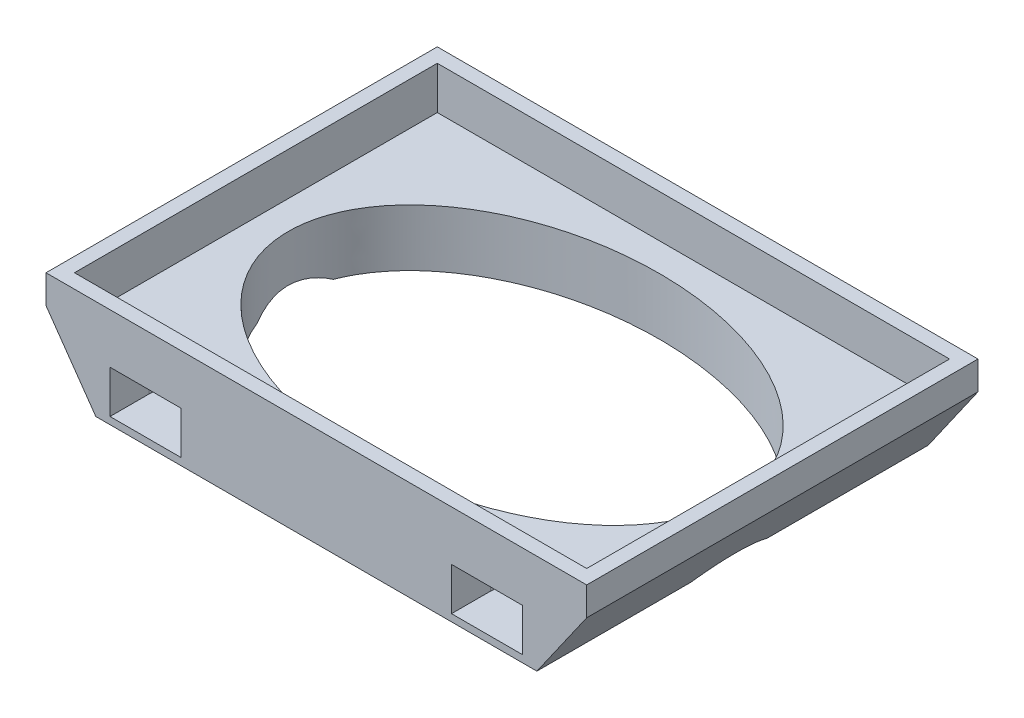
ISO-10303-21;
HEADER;
FILE_DESCRIPTION(('STEP AP214'),'2;1');
FILE_NAME('part.step','',(''),(''),'','','');
FILE_SCHEMA(('AUTOMOTIVE_DESIGN { 1 0 10303 214 1 1 1 1 }'));
ENDSEC;
DATA;
#1=APPLICATION_CONTEXT('core data for automotive mechanical design processes');
#2=APPLICATION_PROTOCOL_DEFINITION('international standard','automotive_design',2000,#1);
#3=PRODUCT_CONTEXT('',#1,'mechanical');
#4=PRODUCT('Part','Part','',(#3));
#5=PRODUCT_RELATED_PRODUCT_CATEGORY('part','',(#4));
#6=PRODUCT_DEFINITION_FORMATION('','',#4);
#7=PRODUCT_DEFINITION_CONTEXT('part definition',#1,'design');
#8=PRODUCT_DEFINITION('design','',#6,#7);
#9=PRODUCT_DEFINITION_SHAPE('','',#8);
#10=(LENGTH_UNIT() NAMED_UNIT(*) SI_UNIT(.MILLI.,.METRE.));
#11=(NAMED_UNIT(*) PLANE_ANGLE_UNIT() SI_UNIT($,.RADIAN.));
#12=(NAMED_UNIT(*) SI_UNIT($,.STERADIAN.) SOLID_ANGLE_UNIT());
#13=UNCERTAINTY_MEASURE_WITH_UNIT(LENGTH_MEASURE(1.E-05),#10,'distance_accuracy_value','');
#14=(GEOMETRIC_REPRESENTATION_CONTEXT(3) GLOBAL_UNCERTAINTY_ASSIGNED_CONTEXT((#13)) GLOBAL_UNIT_ASSIGNED_CONTEXT((#10,
#11,#12)) REPRESENTATION_CONTEXT('',''));
#15=CARTESIAN_POINT('',(0.,0.,0.));
#16=DIRECTION('',(0.,0.,1.));
#17=DIRECTION('',(1.,0.,0.));
#18=AXIS2_PLACEMENT_3D('',#15,#16,#17);
#19=CARTESIAN_POINT('',(0.,-7.,0.));
#20=DIRECTION('',(0.,-1.,0.));
#21=DIRECTION('',(0.,0.,-1.));
#22=AXIS2_PLACEMENT_3D('',#19,#20,#21);
#23=PLANE('',#22);
#24=DIRECTION('',(0.,0.,1.));
#25=VECTOR('',#24,1.);
#26=CARTESIAN_POINT('',(-15.4989623089515,-7.,-13.75));
#27=LINE('',#26,#25);
#28=CARTESIAN_POINT('',(-15.4989623089515,-7.,-13.75));
#29=VERTEX_POINT('',#28);
#30=CARTESIAN_POINT('',(-15.4989623089515,-7.,-2.94454676204636));
#31=VERTEX_POINT('',#30);
#32=EDGE_CURVE('E61',#29,#31,#27,.T.);
#33=ORIENTED_EDGE('',*,*,#32,.F.);
#34=DIRECTION('',(-1.,0.,0.));
#35=VECTOR('',#34,1.);
#36=CARTESIAN_POINT('',(-19.,-7.,-13.75));
#37=LINE('',#36,#35);
#38=CARTESIAN_POINT('',(15.4989623089515,-7.,-13.75));
#39=VERTEX_POINT('',#38);
#40=EDGE_CURVE('E243',#39,#29,#37,.T.);
#41=ORIENTED_EDGE('',*,*,#40,.F.);
#42=DIRECTION('',(0.,0.,1.));
#43=VECTOR('',#42,1.);
#44=CARTESIAN_POINT('',(15.4989623089515,-7.,-13.75));
#45=LINE('',#44,#43);
#46=CARTESIAN_POINT('',(15.4989623089515,-7.,-2.41548609609659));
#47=VERTEX_POINT('',#46);
#48=EDGE_CURVE('E240',#39,#47,#45,.T.);
#49=ORIENTED_EDGE('',*,*,#48,.T.);
#50=CARTESIAN_POINT('',(0.,-7.,0.));
#51=DIRECTION('',(0.,1.,0.));
#52=DIRECTION('',(0.999515945982097,0.,0.0311106690303014));
#53=AXIS2_PLACEMENT_3D('',#50,#51,#52);
#54=ELLIPSE('',#53,16.0077486150347,10.7552061007264);
#55=EDGE_CURVE('E276',#47,#31,#54,.T.);
#56=ORIENTED_EDGE('',*,*,#55,.T.);
#57=EDGE_LOOP('',(#33,#41,#49,#56));
#58=FACE_BOUND('',#57,.T.);
#59=ADVANCED_FACE('F32',(#58),#23,.T.);
#60=CARTESIAN_POINT('',(-19.,-7.,-13.75));
#61=DIRECTION('',(0.,0.,-1.));
#62=DIRECTION('',(-1.,0.,0.));
#63=AXIS2_PLACEMENT_3D('',#60,#61,#62);
#64=PLANE('',#63);
#65=DIRECTION('',(-0.573576436351042,0.819152044288995,0.));
#66=VECTOR('',#65,1.);
#67=CARTESIAN_POINT('',(-15.4989623089515,-7.,-13.75));
#68=LINE('',#67,#66);
#69=CARTESIAN_POINT('',(-19.,-2.,-13.75));
#70=VERTEX_POINT('',#69);
#71=EDGE_CURVE('E229',#29,#70,#68,.T.);
#72=ORIENTED_EDGE('',*,*,#71,.T.);
#73=DIRECTION('',(0.,1.,0.));
#74=VECTOR('',#73,1.);
#75=CARTESIAN_POINT('',(-19.,-7.,-13.75));
#76=LINE('',#75,#74);
#77=CARTESIAN_POINT('',(-19.,0.,-13.75));
#78=VERTEX_POINT('',#77);
#79=EDGE_CURVE('E264',#70,#78,#76,.T.);
#80=ORIENTED_EDGE('',*,*,#79,.T.);
#81=DIRECTION('',(-1.,0.,0.));
#82=VECTOR('',#81,1.);
#83=CARTESIAN_POINT('',(-19.,0.,-13.75));
#84=LINE('',#83,#82);
#85=CARTESIAN_POINT('',(19.,0.,-13.75));
#86=VERTEX_POINT('',#85);
#87=EDGE_CURVE('E244',#86,#78,#84,.T.);
#88=ORIENTED_EDGE('',*,*,#87,.F.);
#89=DIRECTION('',(0.,1.,0.));
#90=VECTOR('',#89,1.);
#91=CARTESIAN_POINT('',(19.,-7.,-13.75));
#92=LINE('',#91,#90);
#93=CARTESIAN_POINT('',(19.,-2.,-13.75));
#94=VERTEX_POINT('',#93);
#95=EDGE_CURVE('E267',#94,#86,#92,.T.);
#96=ORIENTED_EDGE('',*,*,#95,.F.);
#97=DIRECTION('',(-0.573576436351042,-0.819152044288995,0.));
#98=VECTOR('',#97,1.);
#99=CARTESIAN_POINT('',(15.4989623089515,-7.,-13.75));
#100=LINE('',#99,#98);
#101=EDGE_CURVE('E764',#94,#39,#100,.T.);
#102=ORIENTED_EDGE('',*,*,#101,.T.);
#103=ORIENTED_EDGE('',*,*,#40,.T.);
#104=EDGE_LOOP('',(#72,#80,#88,#96,#102,#103));
#105=FACE_BOUND('',#104,.T.);
#106=DIRECTION('',(1.,0.,0.));
#107=VECTOR('',#106,1.);
#108=CARTESIAN_POINT('',(-19.,-3.5,-13.75));
#109=LINE('',#108,#107);
#110=CARTESIAN_POINT('',(-14.5,-3.5,-13.75));
#111=VERTEX_POINT('',#110);
#112=CARTESIAN_POINT('',(-9.5,-3.5,-13.75));
#113=VERTEX_POINT('',#112);
#114=EDGE_CURVE('E314',#111,#113,#109,.T.);
#115=ORIENTED_EDGE('',*,*,#114,.F.);
#116=DIRECTION('',(0.,1.,0.));
#117=VECTOR('',#116,1.);
#118=CARTESIAN_POINT('',(-14.5,-7.,-13.75));
#119=LINE('',#118,#117);
#120=CARTESIAN_POINT('',(-14.5,-6.5,-13.75));
#121=VERTEX_POINT('',#120);
#122=EDGE_CURVE('E309',#121,#111,#119,.T.);
#123=ORIENTED_EDGE('',*,*,#122,.F.);
#124=DIRECTION('',(1.,0.,0.));
#125=VECTOR('',#124,1.);
#126=CARTESIAN_POINT('',(-19.,-6.5,-13.75));
#127=LINE('',#126,#125);
#128=CARTESIAN_POINT('',(-9.49999999999996,-6.5,-13.75));
#129=VERTEX_POINT('',#128);
#130=EDGE_CURVE('E306',#121,#129,#127,.T.);
#131=ORIENTED_EDGE('',*,*,#130,.T.);
#132=DIRECTION('',(0.,-1.,0.));
#133=VECTOR('',#132,1.);
#134=CARTESIAN_POINT('',(-9.5,-7.,-13.75));
#135=LINE('',#134,#133);
#136=EDGE_CURVE('E311',#113,#129,#135,.T.);
#137=ORIENTED_EDGE('',*,*,#136,.F.);
#138=EDGE_LOOP('',(#115,#123,#131,#137));
#139=FACE_BOUND('',#138,.T.);
#140=DIRECTION('',(0.,-1.,0.));
#141=VECTOR('',#140,1.);
#142=CARTESIAN_POINT('',(14.5,-7.,-13.75));
#143=LINE('',#142,#141);
#144=CARTESIAN_POINT('',(14.5,-3.5,-13.75));
#145=VERTEX_POINT('',#144);
#146=CARTESIAN_POINT('',(14.5,-6.5,-13.75));
#147=VERTEX_POINT('',#146);
#148=EDGE_CURVE('E300',#145,#147,#143,.T.);
#149=ORIENTED_EDGE('',*,*,#148,.F.);
#150=DIRECTION('',(-1.,0.,0.));
#151=VECTOR('',#150,1.);
#152=CARTESIAN_POINT('',(-19.,-3.5,-13.75));
#153=LINE('',#152,#151);
#154=CARTESIAN_POINT('',(9.49999999999999,-3.5,-13.75));
#155=VERTEX_POINT('',#154);
#156=EDGE_CURVE('E303',#145,#155,#153,.T.);
#157=ORIENTED_EDGE('',*,*,#156,.T.);
#158=DIRECTION('',(0.,1.,0.));
#159=VECTOR('',#158,1.);
#160=CARTESIAN_POINT('',(9.49999999999999,-7.,-13.75));
#161=LINE('',#160,#159);
#162=CARTESIAN_POINT('',(9.49999999999999,-6.5,-13.75));
#163=VERTEX_POINT('',#162);
#164=EDGE_CURVE('E298',#163,#155,#161,.T.);
#165=ORIENTED_EDGE('',*,*,#164,.F.);
#166=DIRECTION('',(-1.,0.,0.));
#167=VECTOR('',#166,1.);
#168=CARTESIAN_POINT('',(-19.,-6.5,-13.75));
#169=LINE('',#168,#167);
#170=EDGE_CURVE('E296',#147,#163,#169,.T.);
#171=ORIENTED_EDGE('',*,*,#170,.F.);
#172=EDGE_LOOP('',(#149,#157,#165,#171));
#173=FACE_BOUND('',#172,.T.);
#174=ADVANCED_FACE('F412',(#105,#139,#173),#64,.T.);
#175=CARTESIAN_POINT('',(-19.,-7.,13.75));
#176=DIRECTION('',(0.,0.,1.));
#177=DIRECTION('',(1.,0.,0.));
#178=AXIS2_PLACEMENT_3D('',#175,#176,#177);
#179=PLANE('',#178);
#180=DIRECTION('',(-0.573576436351042,0.819152044288995,0.));
#181=VECTOR('',#180,1.);
#182=CARTESIAN_POINT('',(-15.4989623089515,-7.,13.75));
#183=LINE('',#182,#181);
#184=CARTESIAN_POINT('',(-15.4989623089515,-7.,13.75));
#185=VERTEX_POINT('',#184);
#186=CARTESIAN_POINT('',(-19.,-2.,13.75));
#187=VERTEX_POINT('',#186);
#188=EDGE_CURVE('E223',#185,#187,#183,.T.);
#189=ORIENTED_EDGE('',*,*,#188,.F.);
#190=DIRECTION('',(1.,0.,0.));
#191=VECTOR('',#190,1.);
#192=CARTESIAN_POINT('',(-19.,-7.,13.75));
#193=LINE('',#192,#191);
#194=CARTESIAN_POINT('',(15.4989623089515,-7.,13.75));
#195=VERTEX_POINT('',#194);
#196=EDGE_CURVE('E237',#185,#195,#193,.T.);
#197=ORIENTED_EDGE('',*,*,#196,.T.);
#198=DIRECTION('',(-0.573576436351042,-0.819152044288995,0.));
#199=VECTOR('',#198,1.);
#200=CARTESIAN_POINT('',(15.4989623089515,-7.,13.75));
#201=LINE('',#200,#199);
#202=CARTESIAN_POINT('',(19.,-2.,13.75));
#203=VERTEX_POINT('',#202);
#204=EDGE_CURVE('E769',#203,#195,#201,.T.);
#205=ORIENTED_EDGE('',*,*,#204,.F.);
#206=DIRECTION('',(0.,1.,0.));
#207=VECTOR('',#206,1.);
#208=CARTESIAN_POINT('',(19.,-7.,13.75));
#209=LINE('',#208,#207);
#210=CARTESIAN_POINT('',(19.,0.,13.75));
#211=VERTEX_POINT('',#210);
#212=EDGE_CURVE('E269',#203,#211,#209,.T.);
#213=ORIENTED_EDGE('',*,*,#212,.T.);
#214=DIRECTION('',(1.,0.,0.));
#215=VECTOR('',#214,1.);
#216=CARTESIAN_POINT('',(-19.,0.,13.75));
#217=LINE('',#216,#215);
#218=CARTESIAN_POINT('',(-19.,0.,13.75));
#219=VERTEX_POINT('',#218);
#220=EDGE_CURVE('E258',#219,#211,#217,.T.);
#221=ORIENTED_EDGE('',*,*,#220,.F.);
#222=DIRECTION('',(0.,1.,0.));
#223=VECTOR('',#222,1.);
#224=CARTESIAN_POINT('',(-19.,-7.,13.75));
#225=LINE('',#224,#223);
#226=EDGE_CURVE('E239',#187,#219,#225,.T.);
#227=ORIENTED_EDGE('',*,*,#226,.F.);
#228=EDGE_LOOP('',(#189,#197,#205,#213,#221,#227));
#229=FACE_BOUND('',#228,.T.);
#230=DIRECTION('',(-1.,0.,0.));
#231=VECTOR('',#230,1.);
#232=CARTESIAN_POINT('',(-19.,-3.5,13.75));
#233=LINE('',#232,#231);
#234=CARTESIAN_POINT('',(14.5,-3.5,13.75));
#235=VERTEX_POINT('',#234);
#236=CARTESIAN_POINT('',(9.49999999999999,-3.5,13.75));
#237=VERTEX_POINT('',#236);
#238=EDGE_CURVE('E294',#235,#237,#233,.T.);
#239=ORIENTED_EDGE('',*,*,#238,.F.);
#240=DIRECTION('',(0.,1.,0.));
#241=VECTOR('',#240,1.);
#242=CARTESIAN_POINT('',(14.5,-7.,13.75));
#243=LINE('',#242,#241);
#244=CARTESIAN_POINT('',(14.5,-6.5,13.75));
#245=VERTEX_POINT('',#244);
#246=EDGE_CURVE('E289',#245,#235,#243,.T.);
#247=ORIENTED_EDGE('',*,*,#246,.F.);
#248=DIRECTION('',(-1.,0.,0.));
#249=VECTOR('',#248,1.);
#250=CARTESIAN_POINT('',(-19.,-6.5,13.75));
#251=LINE('',#250,#249);
#252=CARTESIAN_POINT('',(9.49999999999995,-6.5,13.75));
#253=VERTEX_POINT('',#252);
#254=EDGE_CURVE('E286',#245,#253,#251,.T.);
#255=ORIENTED_EDGE('',*,*,#254,.T.);
#256=DIRECTION('',(0.,-1.,0.));
#257=VECTOR('',#256,1.);
#258=CARTESIAN_POINT('',(9.49999999999999,-7.,13.75));
#259=LINE('',#258,#257);
#260=EDGE_CURVE('E291',#237,#253,#259,.T.);
#261=ORIENTED_EDGE('',*,*,#260,.F.);
#262=EDGE_LOOP('',(#239,#247,#255,#261));
#263=FACE_BOUND('',#262,.T.);
#264=DIRECTION('',(0.,-1.,0.));
#265=VECTOR('',#264,1.);
#266=CARTESIAN_POINT('',(-14.5,-7.,13.75));
#267=LINE('',#266,#265);
#268=CARTESIAN_POINT('',(-14.5,-3.5,13.75));
#269=VERTEX_POINT('',#268);
#270=CARTESIAN_POINT('',(-14.5,-6.5,13.75));
#271=VERTEX_POINT('',#270);
#272=EDGE_CURVE('E280',#269,#271,#267,.T.);
#273=ORIENTED_EDGE('',*,*,#272,.F.);
#274=DIRECTION('',(1.,0.,0.));
#275=VECTOR('',#274,1.);
#276=CARTESIAN_POINT('',(-19.,-3.5,13.75));
#277=LINE('',#276,#275);
#278=CARTESIAN_POINT('',(-9.5,-3.5,13.75));
#279=VERTEX_POINT('',#278);
#280=EDGE_CURVE('E283',#269,#279,#277,.T.);
#281=ORIENTED_EDGE('',*,*,#280,.T.);
#282=DIRECTION('',(0.,1.,0.));
#283=VECTOR('',#282,1.);
#284=CARTESIAN_POINT('',(-9.5,-7.,13.75));
#285=LINE('',#284,#283);
#286=CARTESIAN_POINT('',(-9.5,-6.5,13.75));
#287=VERTEX_POINT('',#286);
#288=EDGE_CURVE('E278',#287,#279,#285,.T.);
#289=ORIENTED_EDGE('',*,*,#288,.F.);
#290=DIRECTION('',(1.,0.,0.));
#291=VECTOR('',#290,1.);
#292=CARTESIAN_POINT('',(-19.,-6.5,13.75));
#293=LINE('',#292,#291);
#294=EDGE_CURVE('E266',#271,#287,#293,.T.);
#295=ORIENTED_EDGE('',*,*,#294,.F.);
#296=EDGE_LOOP('',(#273,#281,#289,#295));
#297=FACE_BOUND('',#296,.T.);
#298=ADVANCED_FACE('F234',(#229,#263,#297),#179,.T.);
#299=CARTESIAN_POINT('',(-19.,-7.,13.75));
#300=DIRECTION('',(-1.,0.,0.));
#301=DIRECTION('',(0.,0.,1.));
#302=AXIS2_PLACEMENT_3D('',#299,#300,#301);
#303=PLANE('',#302);
#304=DIRECTION('',(0.,0.,1.));
#305=VECTOR('',#304,1.);
#306=CARTESIAN_POINT('',(-19.,-2.,-13.75));
#307=LINE('',#306,#305);
#308=EDGE_CURVE('E715',#70,#187,#307,.T.);
#309=ORIENTED_EDGE('',*,*,#308,.T.);
#310=ORIENTED_EDGE('',*,*,#226,.T.);
#311=DIRECTION('',(0.,0.,1.));
#312=VECTOR('',#311,1.);
#313=CARTESIAN_POINT('',(-19.,0.,13.75));
#314=LINE('',#313,#312);
#315=EDGE_CURVE('E255',#78,#219,#314,.T.);
#316=ORIENTED_EDGE('',*,*,#315,.F.);
#317=ORIENTED_EDGE('',*,*,#79,.F.);
#318=EDGE_LOOP('',(#309,#310,#316,#317));
#319=FACE_BOUND('',#318,.T.);
#320=ADVANCED_FACE('F34',(#319),#303,.T.);
#321=CARTESIAN_POINT('',(19.,-7.,13.75));
#322=DIRECTION('',(1.,0.,0.));
#323=DIRECTION('',(0.,0.,-1.));
#324=AXIS2_PLACEMENT_3D('',#321,#322,#323);
#325=PLANE('',#324);
#326=DIRECTION('',(0.,0.,1.));
#327=VECTOR('',#326,1.);
#328=CARTESIAN_POINT('',(19.,-2.,-13.75));
#329=LINE('',#328,#327);
#330=EDGE_CURVE('E762',#94,#203,#329,.T.);
#331=ORIENTED_EDGE('',*,*,#330,.F.);
#332=ORIENTED_EDGE('',*,*,#95,.T.);
#333=DIRECTION('',(0.,0.,-1.));
#334=VECTOR('',#333,1.);
#335=CARTESIAN_POINT('',(19.,0.,13.75));
#336=LINE('',#335,#334);
#337=EDGE_CURVE('E249',#211,#86,#336,.T.);
#338=ORIENTED_EDGE('',*,*,#337,.F.);
#339=ORIENTED_EDGE('',*,*,#212,.F.);
#340=EDGE_LOOP('',(#331,#332,#338,#339));
#341=FACE_BOUND('',#340,.T.);
#342=ADVANCED_FACE('F424',(#341),#325,.T.);
#343=CARTESIAN_POINT('',(-15.4989623089515,-7.,2.41548609609659));
#344=VERTEX_POINT('',#343);
#345=EDGE_CURVE('E220',#344,#185,#27,.T.);
#346=ORIENTED_EDGE('',*,*,#345,.F.);
#347=CARTESIAN_POINT('',(15.4989623089515,-7.,2.94454676204636));
#348=VERTEX_POINT('',#347);
#349=EDGE_CURVE('E677',#344,#348,#54,.T.);
#350=ORIENTED_EDGE('',*,*,#349,.T.);
#351=EDGE_CURVE('E53',#348,#195,#45,.T.);
#352=ORIENTED_EDGE('',*,*,#351,.T.);
#353=ORIENTED_EDGE('',*,*,#196,.F.);
#354=EDGE_LOOP('',(#346,#350,#352,#353));
#355=FACE_BOUND('',#354,.T.);
#356=ADVANCED_FACE('F242',(#355),#23,.T.);
#357=CARTESIAN_POINT('',(0.,0.,0.));
#358=DIRECTION('',(0.,-1.,0.));
#359=DIRECTION('',(0.,0.,-1.));
#360=AXIS2_PLACEMENT_3D('',#357,#358,#359);
#361=PLANE('',#360);
#362=DIRECTION('',(1.,0.,0.));
#363=VECTOR('',#362,1.);
#364=CARTESIAN_POINT('',(-18.,0.,12.75));
#365=LINE('',#364,#363);
#366=CARTESIAN_POINT('',(-18.,0.,12.75));
#367=VERTEX_POINT('',#366);
#368=CARTESIAN_POINT('',(18.,0.,12.75));
#369=VERTEX_POINT('',#368);
#370=EDGE_CURVE('E644',#367,#369,#365,.T.);
#371=ORIENTED_EDGE('',*,*,#370,.F.);
#372=DIRECTION('',(0.,0.,1.));
#373=VECTOR('',#372,1.);
#374=CARTESIAN_POINT('',(-18.,0.,-12.75));
#375=LINE('',#374,#373);
#376=CARTESIAN_POINT('',(-18.,0.,-12.75));
#377=VERTEX_POINT('',#376);
#378=EDGE_CURVE('E275',#377,#367,#375,.T.);
#379=ORIENTED_EDGE('',*,*,#378,.F.);
#380=DIRECTION('',(-1.,0.,0.));
#381=VECTOR('',#380,1.);
#382=CARTESIAN_POINT('',(-18.,0.,-12.75));
#383=LINE('',#382,#381);
#384=CARTESIAN_POINT('',(18.,0.,-12.75));
#385=VERTEX_POINT('',#384);
#386=EDGE_CURVE('E657',#385,#377,#383,.T.);
#387=ORIENTED_EDGE('',*,*,#386,.F.);
#388=DIRECTION('',(0.,0.,-1.));
#389=VECTOR('',#388,1.);
#390=CARTESIAN_POINT('',(18.,0.,-12.75));
#391=LINE('',#390,#389);
#392=EDGE_CURVE('E655',#369,#385,#391,.T.);
#393=ORIENTED_EDGE('',*,*,#392,.F.);
#394=EDGE_LOOP('',(#371,#379,#387,#393));
#395=FACE_BOUND('',#394,.T.);
#396=ORIENTED_EDGE('',*,*,#315,.T.);
#397=ORIENTED_EDGE('',*,*,#220,.T.);
#398=ORIENTED_EDGE('',*,*,#337,.T.);
#399=ORIENTED_EDGE('',*,*,#87,.T.);
#400=EDGE_LOOP('',(#396,#397,#398,#399));
#401=FACE_BOUND('',#400,.T.);
#402=ADVANCED_FACE('F423',(#395,#401),#361,.F.);
#403=CARTESIAN_POINT('',(-18.,-3.,-12.75));
#404=DIRECTION('',(-1.,0.,0.));
#405=DIRECTION('',(0.,0.,1.));
#406=AXIS2_PLACEMENT_3D('',#403,#404,#405);
#407=PLANE('',#406);
#408=ORIENTED_EDGE('',*,*,#378,.T.);
#409=DIRECTION('',(0.,1.,0.));
#410=VECTOR('',#409,1.);
#411=CARTESIAN_POINT('',(-18.,-3.,12.75));
#412=LINE('',#411,#410);
#413=CARTESIAN_POINT('',(-18.,-3.,12.75));
#414=VERTEX_POINT('',#413);
#415=EDGE_CURVE('E252',#414,#367,#412,.T.);
#416=ORIENTED_EDGE('',*,*,#415,.F.);
#417=DIRECTION('',(0.,0.,1.));
#418=VECTOR('',#417,1.);
#419=CARTESIAN_POINT('',(-18.,-3.,-12.75));
#420=LINE('',#419,#418);
#421=CARTESIAN_POINT('',(-18.,-3.,-12.75));
#422=VERTEX_POINT('',#421);
#423=EDGE_CURVE('E662',#422,#414,#420,.T.);
#424=ORIENTED_EDGE('',*,*,#423,.F.);
#425=DIRECTION('',(0.,1.,0.));
#426=VECTOR('',#425,1.);
#427=CARTESIAN_POINT('',(-18.,-3.,-12.75));
#428=LINE('',#427,#426);
#429=EDGE_CURVE('E259',#422,#377,#428,.T.);
#430=ORIENTED_EDGE('',*,*,#429,.T.);
#431=EDGE_LOOP('',(#408,#416,#424,#430));
#432=FACE_BOUND('',#431,.T.);
#433=ADVANCED_FACE('F429',(#432),#407,.F.);
#434=CARTESIAN_POINT('',(-18.,-3.,-12.75));
#435=DIRECTION('',(0.,0.,-1.));
#436=DIRECTION('',(-1.,0.,0.));
#437=AXIS2_PLACEMENT_3D('',#434,#435,#436);
#438=PLANE('',#437);
#439=ORIENTED_EDGE('',*,*,#386,.T.);
#440=ORIENTED_EDGE('',*,*,#429,.F.);
#441=DIRECTION('',(-1.,0.,0.));
#442=VECTOR('',#441,1.);
#443=CARTESIAN_POINT('',(-18.,-3.,-12.75));
#444=LINE('',#443,#442);
#445=CARTESIAN_POINT('',(18.,-3.,-12.75));
#446=VERTEX_POINT('',#445);
#447=EDGE_CURVE('E652',#446,#422,#444,.T.);
#448=ORIENTED_EDGE('',*,*,#447,.F.);
#449=DIRECTION('',(0.,1.,0.));
#450=VECTOR('',#449,1.);
#451=CARTESIAN_POINT('',(18.,-3.,-12.75));
#452=LINE('',#451,#450);
#453=EDGE_CURVE('E664',#446,#385,#452,.T.);
#454=ORIENTED_EDGE('',*,*,#453,.T.);
#455=EDGE_LOOP('',(#439,#440,#448,#454));
#456=FACE_BOUND('',#455,.T.);
#457=ADVANCED_FACE('F610',(#456),#438,.F.);
#458=CARTESIAN_POINT('',(18.,-3.,-12.75));
#459=DIRECTION('',(1.,0.,0.));
#460=DIRECTION('',(0.,0.,-1.));
#461=AXIS2_PLACEMENT_3D('',#458,#459,#460);
#462=PLANE('',#461);
#463=ORIENTED_EDGE('',*,*,#392,.T.);
#464=ORIENTED_EDGE('',*,*,#453,.F.);
#465=DIRECTION('',(0.,0.,-1.));
#466=VECTOR('',#465,1.);
#467=CARTESIAN_POINT('',(18.,-3.,-12.75));
#468=LINE('',#467,#466);
#469=CARTESIAN_POINT('',(18.,-3.,12.75));
#470=VERTEX_POINT('',#469);
#471=EDGE_CURVE('E667',#470,#446,#468,.T.);
#472=ORIENTED_EDGE('',*,*,#471,.F.);
#473=DIRECTION('',(0.,1.,0.));
#474=VECTOR('',#473,1.);
#475=CARTESIAN_POINT('',(18.,-3.,12.75));
#476=LINE('',#475,#474);
#477=EDGE_CURVE('E651',#470,#369,#476,.T.);
#478=ORIENTED_EDGE('',*,*,#477,.T.);
#479=EDGE_LOOP('',(#463,#464,#472,#478));
#480=FACE_BOUND('',#479,.T.);
#481=ADVANCED_FACE('F600',(#480),#462,.F.);
#482=CARTESIAN_POINT('',(-18.,-3.,12.75));
#483=DIRECTION('',(0.,0.,1.));
#484=DIRECTION('',(1.,0.,0.));
#485=AXIS2_PLACEMENT_3D('',#482,#483,#484);
#486=PLANE('',#485);
#487=ORIENTED_EDGE('',*,*,#370,.T.);
#488=ORIENTED_EDGE('',*,*,#477,.F.);
#489=DIRECTION('',(1.,0.,0.));
#490=VECTOR('',#489,1.);
#491=CARTESIAN_POINT('',(-18.,-3.,12.75));
#492=LINE('',#491,#490);
#493=EDGE_CURVE('E649',#414,#470,#492,.T.);
#494=ORIENTED_EDGE('',*,*,#493,.F.);
#495=ORIENTED_EDGE('',*,*,#415,.T.);
#496=EDGE_LOOP('',(#487,#488,#494,#495));
#497=FACE_BOUND('',#496,.T.);
#498=ADVANCED_FACE('F591',(#497),#486,.F.);
#499=CARTESIAN_POINT('',(0.,-3.,0.));
#500=DIRECTION('',(0.,1.,0.));
#501=DIRECTION('',(0.,0.,1.));
#502=AXIS2_PLACEMENT_3D('',#499,#500,#501);
#503=PLANE('',#502);
#504=CARTESIAN_POINT('',(0.,-3.,0.));
#505=DIRECTION('',(0.,1.,0.));
#506=DIRECTION('',(0.999515945982097,0.,0.0311106690303014));
#507=AXIS2_PLACEMENT_3D('',#504,#505,#506);
#508=ELLIPSE('',#507,16.0077486150347,10.7552061007264);
#509=CARTESIAN_POINT('',(16.,-3.,0.49801176908261));
#510=VERTEX_POINT('',#509);
#511=EDGE_CURVE('E272',#510,#510,#508,.T.);
#512=ORIENTED_EDGE('',*,*,#511,.F.);
#513=EDGE_LOOP('',(#512));
#514=FACE_BOUND('',#513,.T.);
#515=ORIENTED_EDGE('',*,*,#423,.T.);
#516=ORIENTED_EDGE('',*,*,#493,.T.);
#517=ORIENTED_EDGE('',*,*,#471,.T.);
#518=ORIENTED_EDGE('',*,*,#447,.T.);
#519=EDGE_LOOP('',(#515,#516,#517,#518));
#520=FACE_BOUND('',#519,.T.);
#521=ADVANCED_FACE('F465',(#514,#520),#503,.T.);
#522=DIRECTION('',(0.,1.,0.));
#523=VECTOR('',#522,1.);
#524=SURFACE_OF_LINEAR_EXTRUSION('',#54,#523);
#525=ORIENTED_EDGE('',*,*,#511,.T.);
#526=EDGE_LOOP('',(#525));
#527=FACE_BOUND('',#526,.T.);
#528=ORIENTED_EDGE('',*,*,#349,.F.);
#529=CARTESIAN_POINT('',(-15.4989623089515,-7.,2.41548609609659));
#530=CARTESIAN_POINT('',(-15.5268552376283,-6.96016476950799,2.34211426842763));
#531=CARTESIAN_POINT('',(-15.5539144933535,-6.92152014738009,2.26776592821796));
#532=CARTESIAN_POINT('',(-15.6062340248589,-6.84680011274704,2.1170345722142));
#533=CARTESIAN_POINT('',(-15.6314918284779,-6.81072823085382,2.04064895076864));
#534=CARTESIAN_POINT('',(-15.6800104212541,-6.74143649929057,1.8859283906734));
#535=CARTESIAN_POINT('',(-15.7032704125864,-6.70821778903258,1.80759268922011));
#536=CARTESIAN_POINT('',(-15.7477946518911,-6.64463058541789,1.6483726484809));
#537=CARTESIAN_POINT('',(-15.76903990399,-6.61428922098007,1.56747212857225));
#538=CARTESIAN_POINT('',(-15.8091096047397,-6.55706375772362,1.40389637374116));
#539=CARTESIAN_POINT('',(-15.8279349144082,-6.53017842924423,1.32122178232073));
#540=CARTESIAN_POINT('',(-15.862983155163,-6.48012435407052,1.15422263232227));
#541=CARTESIAN_POINT('',(-15.8792063057086,-6.45695529395567,1.06989821356016));
#542=CARTESIAN_POINT('',(-15.9164663878801,-6.40374238187141,0.856195378036507));
#543=CARTESIAN_POINT('',(-15.9357163319303,-6.37625061264616,0.725850401819389));
#544=CARTESIAN_POINT('',(-15.9672935230436,-6.33115371009919,0.462617551698967));
#545=CARTESIAN_POINT('',(-15.979620272461,-6.31354928748921,0.32972949570648));
#546=CARTESIAN_POINT('',(-15.9969046030017,-6.28886470527965,0.0631538915183078));
#547=CARTESIAN_POINT('',(-16.0018981791855,-6.28173313940612,-0.0705264956336931));
#548=CARTESIAN_POINT('',(-16.0044434222135,-6.27809815564906,-0.338093134558099));
#549=CARTESIAN_POINT('',(-16.0019959825213,-6.28159346176718,-0.471979359685555));
#550=CARTESIAN_POINT('',(-15.990339798302,-6.29824021802614,-0.725346973106835));
#551=CARTESIAN_POINT('',(-15.9818324075215,-6.31039003121187,-0.844928703619699));
#552=CARTESIAN_POINT('',(-15.9590548496576,-6.34291975507359,-1.08240331317752));
#553=CARTESIAN_POINT('',(-15.9447847984702,-6.36329950023308,-1.20029622613781));
#554=CARTESIAN_POINT('',(-15.9107549556847,-6.41189915237691,-1.43407781732184));
#555=CARTESIAN_POINT('',(-15.8909759793227,-6.44014645804372,-1.54995796007212));
#556=CARTESIAN_POINT('',(-15.8463787935985,-6.503837839942,-1.7787016632034));
#557=CARTESIAN_POINT('',(-15.8215609990775,-6.53928132371898,-1.89156547105131));
#558=CARTESIAN_POINT('',(-15.7541030110031,-6.63562131492615,-2.16820904352916));
#559=CARTESIAN_POINT('',(-15.7086792792389,-6.70049312690402,-2.32992482095271));
#560=CARTESIAN_POINT('',(-15.609605561328,-6.841985059659,-2.6440259398538));
#561=CARTESIAN_POINT('',(-15.5560171845874,-6.91851719308562,-2.79647009731348));
#562=CARTESIAN_POINT('',(-15.4989623089515,-7.,-2.94454676204636));
#563=B_SPLINE_CURVE_WITH_KNOTS('',3,(#529,#530,#531,#532,#533,#534,#535,#536,#537,#538,#539,
#540,#541,#542,#543,#544,#545,#546,#547,#548,#549,#550,#551,#552,#553,#554,#555,#556,#557,#558,
#559,#560,#561,#562),.UNSPECIFIED.,.F.,.F.,(4,2,2,2,2,2,2,2,2,2,2,2,2,2,2,2,4),(0.,
0.26407197949709,0.528499641172036,0.793032415564454,1.05985255156996,1.32657748839966,
1.59327991849113,1.99650781143741,2.39976468507455,2.80103546855109,3.20225807222133,
3.56331697846423,3.92436862362305,4.28669369559827,4.64898894978219,5.18828672271182,
5.72369999652656),.UNSPECIFIED.);
#564=EDGE_CURVE('E11',#344,#31,#563,.T.);
#565=ORIENTED_EDGE('',*,*,#564,.T.);
#566=ORIENTED_EDGE('',*,*,#55,.F.);
#567=CARTESIAN_POINT('',(15.4989623089515,-7.,-2.41548609609659));
#568=CARTESIAN_POINT('',(15.5268552376283,-6.96016476950799,-2.34211426842763));
#569=CARTESIAN_POINT('',(15.5539144933535,-6.92152014738009,-2.26776592821796));
#570=CARTESIAN_POINT('',(15.6062340248589,-6.84680011274704,-2.1170345722142));
#571=CARTESIAN_POINT('',(15.6314918284779,-6.81072823085382,-2.04064895076864));
#572=CARTESIAN_POINT('',(15.6800104212541,-6.74143649929057,-1.8859283906734));
#573=CARTESIAN_POINT('',(15.7032704125864,-6.70821778903258,-1.8075926892201));
#574=CARTESIAN_POINT('',(15.7477946518911,-6.64463058541789,-1.6483726484809));
#575=CARTESIAN_POINT('',(15.76903990399,-6.61428922098007,-1.56747212857225));
#576=CARTESIAN_POINT('',(15.8091096047397,-6.55706375772362,-1.40389637374116));
#577=CARTESIAN_POINT('',(15.8279349144082,-6.53017842924423,-1.32122178232073));
#578=CARTESIAN_POINT('',(15.862983155163,-6.48012435407052,-1.15422263232227));
#579=CARTESIAN_POINT('',(15.8792063057086,-6.45695529395567,-1.06989821356016));
#580=CARTESIAN_POINT('',(15.9164663878801,-6.40374238187141,-0.85619537803651));
#581=CARTESIAN_POINT('',(15.9357163319303,-6.37625061264616,-0.725850401819392));
#582=CARTESIAN_POINT('',(15.9672935230436,-6.33115371009919,-0.46261755169897));
#583=CARTESIAN_POINT('',(15.979620272461,-6.31354928748921,-0.329729495706484));
#584=CARTESIAN_POINT('',(15.9969046030017,-6.28886470527965,-0.063153891518311));
#585=CARTESIAN_POINT('',(16.0018981791855,-6.28173313940612,0.0705264956336899));
#586=CARTESIAN_POINT('',(16.0044434222135,-6.27809815564906,0.338093134558096));
#587=CARTESIAN_POINT('',(16.0019959825213,-6.28159346176718,0.471979359685552));
#588=CARTESIAN_POINT('',(15.990339798302,-6.29824021802614,0.725346973106832));
#589=CARTESIAN_POINT('',(15.9818324075215,-6.31039003121187,0.844928703619695));
#590=CARTESIAN_POINT('',(15.9590548496576,-6.34291975507359,1.08240331317752));
#591=CARTESIAN_POINT('',(15.9447847984702,-6.36329950023308,1.20029622613781));
#592=CARTESIAN_POINT('',(15.9107549556847,-6.41189915237691,1.43407781732183));
#593=CARTESIAN_POINT('',(15.8909759793227,-6.44014645804372,1.54995796007212));
#594=CARTESIAN_POINT('',(15.8463787935985,-6.503837839942,1.77870166320339));
#595=CARTESIAN_POINT('',(15.8215609990775,-6.53928132371898,1.89156547105131));
#596=CARTESIAN_POINT('',(15.7541030110031,-6.63562131492615,2.16820904352916));
#597=CARTESIAN_POINT('',(15.7086792792389,-6.70049312690402,2.32992482095271));
#598=CARTESIAN_POINT('',(15.609605561328,-6.841985059659,2.6440259398538));
#599=CARTESIAN_POINT('',(15.5560171845874,-6.91851719308562,2.79647009731349));
#600=CARTESIAN_POINT('',(15.4989623089515,-7.,2.94454676204636));
#601=B_SPLINE_CURVE_WITH_KNOTS('',3,(#567,#568,#569,#570,#571,#572,#573,#574,#575,#576,#577,
#578,#579,#580,#581,#582,#583,#584,#585,#586,#587,#588,#589,#590,#591,#592,#593,#594,#595,#596,
#597,#598,#599,#600),.UNSPECIFIED.,.F.,.F.,(4,2,2,2,2,2,2,2,2,2,2,2,2,2,2,2,4),(0.,
0.264071979497089,0.528499641172036,0.793032415564454,1.05985255156996,1.32657748839966,
1.59327991849113,1.99650781143741,2.39976468507455,2.80103546855108,3.20225807222133,
3.56331697846423,3.92436862362305,4.28669369559826,4.64898894978219,5.18828672271182,
5.72369999652656),.UNSPECIFIED.);
#602=EDGE_CURVE('E46',#47,#348,#601,.T.);
#603=ORIENTED_EDGE('',*,*,#602,.T.);
#604=EDGE_LOOP('',(#528,#565,#566,#603));
#605=FACE_BOUND('',#604,.T.);
#606=ADVANCED_FACE('F320',(#527,#605),#524,.F.);
#607=CARTESIAN_POINT('',(-12.,-3.5,11.));
#608=DIRECTION('',(0.,-1.,0.));
#609=DIRECTION('',(0.,0.,-1.));
#610=AXIS2_PLACEMENT_3D('',#607,#608,#609);
#611=CYLINDRICAL_SURFACE('',#610,2.5);
#612=CARTESIAN_POINT('',(-12.,-6.5,11.));
#613=DIRECTION('',(0.,-1.,0.));
#614=DIRECTION('',(0.,0.,-1.));
#615=AXIS2_PLACEMENT_3D('',#612,#613,#614);
#616=CIRCLE('',#615,2.5);
#617=CARTESIAN_POINT('',(-14.5,-6.5,11.));
#618=VERTEX_POINT('',#617);
#619=CARTESIAN_POINT('',(-9.50000000000001,-6.5,11.));
#620=VERTEX_POINT('',#619);
#621=EDGE_CURVE('E705',#618,#620,#616,.T.);
#622=ORIENTED_EDGE('',*,*,#621,.T.);
#623=DIRECTION('',(0.,-1.,0.));
#624=VECTOR('',#623,1.);
#625=CARTESIAN_POINT('',(-9.50000000000001,-3.5,11.));
#626=LINE('',#625,#624);
#627=CARTESIAN_POINT('',(-9.50000000000001,-3.5,11.));
#628=VERTEX_POINT('',#627);
#629=EDGE_CURVE('E722',#628,#620,#626,.T.);
#630=ORIENTED_EDGE('',*,*,#629,.F.);
#631=CARTESIAN_POINT('',(-12.,-3.5,11.));
#632=DIRECTION('',(0.,-1.,0.));
#633=DIRECTION('',(0.,0.,-1.));
#634=AXIS2_PLACEMENT_3D('',#631,#632,#633);
#635=CIRCLE('',#634,2.5);
#636=CARTESIAN_POINT('',(-14.5,-3.5,11.));
#637=VERTEX_POINT('',#636);
#638=EDGE_CURVE('E731',#637,#628,#635,.T.);
#639=ORIENTED_EDGE('',*,*,#638,.F.);
#640=DIRECTION('',(0.,-1.,0.));
#641=VECTOR('',#640,1.);
#642=CARTESIAN_POINT('',(-14.5,-3.5,11.));
#643=LINE('',#642,#641);
#644=EDGE_CURVE('E724',#637,#618,#643,.T.);
#645=ORIENTED_EDGE('',*,*,#644,.T.);
#646=EDGE_LOOP('',(#622,#630,#639,#645));
#647=FACE_BOUND('',#646,.T.);
#648=ADVANCED_FACE('F364',(#647),#611,.F.);
#649=CARTESIAN_POINT('',(-14.5,-3.5,11.));
#650=DIRECTION('',(-1.,0.,0.));
#651=DIRECTION('',(0.,0.,1.));
#652=AXIS2_PLACEMENT_3D('',#649,#650,#651);
#653=PLANE('',#652);
#654=ORIENTED_EDGE('',*,*,#272,.T.);
#655=DIRECTION('',(0.,0.,-1.));
#656=VECTOR('',#655,1.);
#657=CARTESIAN_POINT('',(-14.5,-6.5,11.));
#658=LINE('',#657,#656);
#659=EDGE_CURVE('E729',#271,#618,#658,.T.);
#660=ORIENTED_EDGE('',*,*,#659,.T.);
#661=ORIENTED_EDGE('',*,*,#644,.F.);
#662=DIRECTION('',(0.,0.,-1.));
#663=VECTOR('',#662,1.);
#664=CARTESIAN_POINT('',(-14.5,-3.5,11.));
#665=LINE('',#664,#663);
#666=EDGE_CURVE('E725',#269,#637,#665,.T.);
#667=ORIENTED_EDGE('',*,*,#666,.F.);
#668=EDGE_LOOP('',(#654,#660,#661,#667));
#669=FACE_BOUND('',#668,.T.);
#670=ADVANCED_FACE('F361',(#669),#653,.F.);
#671=CARTESIAN_POINT('',(-9.49999999999996,-3.5,23.5626620578931));
#672=DIRECTION('',(1.,0.,0.));
#673=DIRECTION('',(0.,0.,-1.));
#674=AXIS2_PLACEMENT_3D('',#671,#672,#673);
#675=PLANE('',#674);
#676=ORIENTED_EDGE('',*,*,#288,.T.);
#677=DIRECTION('',(0.,0.,1.));
#678=VECTOR('',#677,1.);
#679=CARTESIAN_POINT('',(-9.49999999999996,-3.5,23.5626620578931));
#680=LINE('',#679,#678);
#681=EDGE_CURVE('E738',#628,#279,#680,.T.);
#682=ORIENTED_EDGE('',*,*,#681,.F.);
#683=ORIENTED_EDGE('',*,*,#629,.T.);
#684=DIRECTION('',(0.,0.,1.));
#685=VECTOR('',#684,1.);
#686=CARTESIAN_POINT('',(-9.49999999999996,-6.5,23.5626620578931));
#687=LINE('',#686,#685);
#688=EDGE_CURVE('E732',#620,#287,#687,.T.);
#689=ORIENTED_EDGE('',*,*,#688,.T.);
#690=EDGE_LOOP('',(#676,#682,#683,#689));
#691=FACE_BOUND('',#690,.T.);
#692=ADVANCED_FACE('F355',(#691),#675,.F.);
#693=CARTESIAN_POINT('',(-12.,-3.5,11.));
#694=DIRECTION('',(0.,-1.,0.));
#695=DIRECTION('',(0.,0.,-1.));
#696=AXIS2_PLACEMENT_3D('',#693,#694,#695);
#697=PLANE('',#696);
#698=ORIENTED_EDGE('',*,*,#666,.T.);
#699=ORIENTED_EDGE('',*,*,#638,.T.);
#700=ORIENTED_EDGE('',*,*,#681,.T.);
#701=ORIENTED_EDGE('',*,*,#280,.F.);
#702=EDGE_LOOP('',(#698,#699,#700,#701));
#703=FACE_BOUND('',#702,.T.);
#704=ADVANCED_FACE('F351',(#703),#697,.T.);
#705=CARTESIAN_POINT('',(-12.,-6.5,11.));
#706=DIRECTION('',(0.,-1.,0.));
#707=DIRECTION('',(0.,0.,-1.));
#708=AXIS2_PLACEMENT_3D('',#705,#706,#707);
#709=PLANE('',#708);
#710=ORIENTED_EDGE('',*,*,#294,.T.);
#711=ORIENTED_EDGE('',*,*,#688,.F.);
#712=ORIENTED_EDGE('',*,*,#621,.F.);
#713=ORIENTED_EDGE('',*,*,#659,.F.);
#714=EDGE_LOOP('',(#710,#711,#712,#713));
#715=FACE_BOUND('',#714,.T.);
#716=ADVANCED_FACE('F354',(#715),#709,.F.);
#717=CARTESIAN_POINT('',(12.,-3.5,11.));
#718=DIRECTION('',(0.,-1.,0.));
#719=DIRECTION('',(0.,0.,-1.));
#720=AXIS2_PLACEMENT_3D('',#717,#718,#719);
#721=CYLINDRICAL_SURFACE('',#720,2.5);
#722=CARTESIAN_POINT('',(12.,-6.5,11.));
#723=DIRECTION('',(0.,-1.,0.));
#724=DIRECTION('',(0.,0.,1.));
#725=AXIS2_PLACEMENT_3D('',#722,#723,#724);
#726=CIRCLE('',#725,2.5);
#727=CARTESIAN_POINT('',(9.5,-6.5,11.));
#728=VERTEX_POINT('',#727);
#729=CARTESIAN_POINT('',(14.5,-6.5,11.));
#730=VERTEX_POINT('',#729);
#731=EDGE_CURVE('E712',#728,#730,#726,.T.);
#732=ORIENTED_EDGE('',*,*,#731,.T.);
#733=DIRECTION('',(0.,-1.,0.));
#734=VECTOR('',#733,1.);
#735=CARTESIAN_POINT('',(14.5,-3.5,11.));
#736=LINE('',#735,#734);
#737=CARTESIAN_POINT('',(14.5,-3.5,11.));
#738=VERTEX_POINT('',#737);
#739=EDGE_CURVE('E699',#738,#730,#736,.T.);
#740=ORIENTED_EDGE('',*,*,#739,.F.);
#741=CARTESIAN_POINT('',(12.,-3.5,11.));
#742=DIRECTION('',(0.,-1.,0.));
#743=DIRECTION('',(0.,0.,1.));
#744=AXIS2_PLACEMENT_3D('',#741,#742,#743);
#745=CIRCLE('',#744,2.5);
#746=CARTESIAN_POINT('',(9.5,-3.5,11.));
#747=VERTEX_POINT('',#746);
#748=EDGE_CURVE('E708',#747,#738,#745,.T.);
#749=ORIENTED_EDGE('',*,*,#748,.F.);
#750=DIRECTION('',(0.,-1.,0.));
#751=VECTOR('',#750,1.);
#752=CARTESIAN_POINT('',(9.5,-3.5,11.));
#753=LINE('',#752,#751);
#754=EDGE_CURVE('E701',#747,#728,#753,.T.);
#755=ORIENTED_EDGE('',*,*,#754,.T.);
#756=EDGE_LOOP('',(#732,#740,#749,#755));
#757=FACE_BOUND('',#756,.T.);
#758=ADVANCED_FACE('F359',(#757),#721,.F.);
#759=CARTESIAN_POINT('',(9.49999999999995,-3.5,23.5626620578931));
#760=DIRECTION('',(-1.,0.,0.));
#761=DIRECTION('',(0.,0.,1.));
#762=AXIS2_PLACEMENT_3D('',#759,#760,#761);
#763=PLANE('',#762);
#764=ORIENTED_EDGE('',*,*,#260,.T.);
#765=DIRECTION('',(0.,0.,-1.));
#766=VECTOR('',#765,1.);
#767=CARTESIAN_POINT('',(9.49999999999995,-6.5,23.5626620578931));
#768=LINE('',#767,#766);
#769=EDGE_CURVE('E706',#253,#728,#768,.T.);
#770=ORIENTED_EDGE('',*,*,#769,.T.);
#771=ORIENTED_EDGE('',*,*,#754,.F.);
#772=DIRECTION('',(0.,0.,-1.));
#773=VECTOR('',#772,1.);
#774=CARTESIAN_POINT('',(9.49999999999995,-3.5,23.5626620578931));
#775=LINE('',#774,#773);
#776=EDGE_CURVE('E702',#237,#747,#775,.T.);
#777=ORIENTED_EDGE('',*,*,#776,.F.);
#778=EDGE_LOOP('',(#764,#770,#771,#777));
#779=FACE_BOUND('',#778,.T.);
#780=ADVANCED_FACE('F382',(#779),#763,.F.);
#781=CARTESIAN_POINT('',(14.5,-3.5,11.));
#782=DIRECTION('',(1.,0.,0.));
#783=DIRECTION('',(0.,0.,-1.));
#784=AXIS2_PLACEMENT_3D('',#781,#782,#783);
#785=PLANE('',#784);
#786=ORIENTED_EDGE('',*,*,#246,.T.);
#787=DIRECTION('',(0.,0.,1.));
#788=VECTOR('',#787,1.);
#789=CARTESIAN_POINT('',(14.5,-3.5,11.));
#790=LINE('',#789,#788);
#791=EDGE_CURVE('E717',#738,#235,#790,.T.);
#792=ORIENTED_EDGE('',*,*,#791,.F.);
#793=ORIENTED_EDGE('',*,*,#739,.T.);
#794=DIRECTION('',(0.,0.,1.));
#795=VECTOR('',#794,1.);
#796=CARTESIAN_POINT('',(14.5,-6.5,11.));
#797=LINE('',#796,#795);
#798=EDGE_CURVE('E709',#730,#245,#797,.T.);
#799=ORIENTED_EDGE('',*,*,#798,.T.);
#800=EDGE_LOOP('',(#786,#792,#793,#799));
#801=FACE_BOUND('',#800,.T.);
#802=ADVANCED_FACE('F376',(#801),#785,.F.);
#803=CARTESIAN_POINT('',(12.,-3.5,11.));
#804=DIRECTION('',(0.,1.,0.));
#805=DIRECTION('',(0.,0.,1.));
#806=AXIS2_PLACEMENT_3D('',#803,#804,#805);
#807=PLANE('',#806);
#808=ORIENTED_EDGE('',*,*,#238,.T.);
#809=ORIENTED_EDGE('',*,*,#776,.T.);
#810=ORIENTED_EDGE('',*,*,#748,.T.);
#811=ORIENTED_EDGE('',*,*,#791,.T.);
#812=EDGE_LOOP('',(#808,#809,#810,#811));
#813=FACE_BOUND('',#812,.T.);
#814=ADVANCED_FACE('F372',(#813),#807,.F.);
#815=CARTESIAN_POINT('',(12.,-6.5,11.));
#816=DIRECTION('',(0.,1.,0.));
#817=DIRECTION('',(0.,0.,1.));
#818=AXIS2_PLACEMENT_3D('',#815,#816,#817);
#819=PLANE('',#818);
#820=ORIENTED_EDGE('',*,*,#798,.F.);
#821=ORIENTED_EDGE('',*,*,#731,.F.);
#822=ORIENTED_EDGE('',*,*,#769,.F.);
#823=ORIENTED_EDGE('',*,*,#254,.F.);
#824=EDGE_LOOP('',(#820,#821,#822,#823));
#825=FACE_BOUND('',#824,.T.);
#826=ADVANCED_FACE('F375',(#825),#819,.T.);
#827=CARTESIAN_POINT('',(12.,-3.5,-11.));
#828=DIRECTION('',(0.,-1.,0.));
#829=DIRECTION('',(0.,0.,-1.));
#830=AXIS2_PLACEMENT_3D('',#827,#828,#829);
#831=CYLINDRICAL_SURFACE('',#830,2.5);
#832=CARTESIAN_POINT('',(12.,-6.5,-11.));
#833=DIRECTION('',(0.,-1.,0.));
#834=DIRECTION('',(0.,0.,-1.));
#835=AXIS2_PLACEMENT_3D('',#832,#833,#834);
#836=CIRCLE('',#835,2.5);
#837=CARTESIAN_POINT('',(14.5,-6.5,-11.));
#838=VERTEX_POINT('',#837);
#839=CARTESIAN_POINT('',(9.5,-6.5,-11.));
#840=VERTEX_POINT('',#839);
#841=EDGE_CURVE('E690',#838,#840,#836,.T.);
#842=ORIENTED_EDGE('',*,*,#841,.T.);
#843=DIRECTION('',(0.,-1.,0.));
#844=VECTOR('',#843,1.);
#845=CARTESIAN_POINT('',(9.5,-3.5,-11.));
#846=LINE('',#845,#844);
#847=CARTESIAN_POINT('',(9.5,-3.5,-11.));
#848=VERTEX_POINT('',#847);
#849=EDGE_CURVE('E678',#848,#840,#846,.T.);
#850=ORIENTED_EDGE('',*,*,#849,.F.);
#851=CARTESIAN_POINT('',(12.,-3.5,-11.));
#852=DIRECTION('',(0.,-1.,0.));
#853=DIRECTION('',(0.,0.,-1.));
#854=AXIS2_PLACEMENT_3D('',#851,#852,#853);
#855=CIRCLE('',#854,2.5);
#856=CARTESIAN_POINT('',(14.5,-3.5,-11.));
#857=VERTEX_POINT('',#856);
#858=EDGE_CURVE('E686',#857,#848,#855,.T.);
#859=ORIENTED_EDGE('',*,*,#858,.F.);
#860=DIRECTION('',(0.,-1.,0.));
#861=VECTOR('',#860,1.);
#862=CARTESIAN_POINT('',(14.5,-3.5,-11.));
#863=LINE('',#862,#861);
#864=EDGE_CURVE('E680',#857,#838,#863,.T.);
#865=ORIENTED_EDGE('',*,*,#864,.T.);
#866=EDGE_LOOP('',(#842,#850,#859,#865));
#867=FACE_BOUND('',#866,.T.);
#868=ADVANCED_FACE('F380',(#867),#831,.F.);
#869=CARTESIAN_POINT('',(14.5,-3.5,-11.));
#870=DIRECTION('',(1.,0.,0.));
#871=DIRECTION('',(0.,0.,-1.));
#872=AXIS2_PLACEMENT_3D('',#869,#870,#871);
#873=PLANE('',#872);
#874=ORIENTED_EDGE('',*,*,#148,.T.);
#875=DIRECTION('',(0.,0.,1.));
#876=VECTOR('',#875,1.);
#877=CARTESIAN_POINT('',(14.5,-6.5,-11.));
#878=LINE('',#877,#876);
#879=EDGE_CURVE('E684',#147,#838,#878,.T.);
#880=ORIENTED_EDGE('',*,*,#879,.T.);
#881=ORIENTED_EDGE('',*,*,#864,.F.);
#882=DIRECTION('',(0.,0.,1.));
#883=VECTOR('',#882,1.);
#884=CARTESIAN_POINT('',(14.5,-3.5,-11.));
#885=LINE('',#884,#883);
#886=EDGE_CURVE('E681',#145,#857,#885,.T.);
#887=ORIENTED_EDGE('',*,*,#886,.F.);
#888=EDGE_LOOP('',(#874,#880,#881,#887));
#889=FACE_BOUND('',#888,.T.);
#890=ADVANCED_FACE('F400',(#889),#873,.F.);
#891=CARTESIAN_POINT('',(9.49999999999996,-3.5,-23.5626620578931));
#892=DIRECTION('',(-1.,0.,0.));
#893=DIRECTION('',(0.,0.,1.));
#894=AXIS2_PLACEMENT_3D('',#891,#892,#893);
#895=PLANE('',#894);
#896=ORIENTED_EDGE('',*,*,#164,.T.);
#897=DIRECTION('',(0.,0.,-1.));
#898=VECTOR('',#897,1.);
#899=CARTESIAN_POINT('',(9.49999999999996,-3.5,-23.5626620578931));
#900=LINE('',#899,#898);
#901=EDGE_CURVE('E694',#848,#155,#900,.T.);
#902=ORIENTED_EDGE('',*,*,#901,.F.);
#903=ORIENTED_EDGE('',*,*,#849,.T.);
#904=DIRECTION('',(0.,0.,-1.));
#905=VECTOR('',#904,1.);
#906=CARTESIAN_POINT('',(9.49999999999996,-6.5,-23.5626620578931));
#907=LINE('',#906,#905);
#908=EDGE_CURVE('E687',#840,#163,#907,.T.);
#909=ORIENTED_EDGE('',*,*,#908,.T.);
#910=EDGE_LOOP('',(#896,#902,#903,#909));
#911=FACE_BOUND('',#910,.T.);
#912=ADVANCED_FACE('F395',(#911),#895,.F.);
#913=CARTESIAN_POINT('',(12.,-3.5,-11.));
#914=DIRECTION('',(0.,-1.,0.));
#915=DIRECTION('',(0.,0.,-1.));
#916=AXIS2_PLACEMENT_3D('',#913,#914,#915);
#917=PLANE('',#916);
#918=ORIENTED_EDGE('',*,*,#886,.T.);
#919=ORIENTED_EDGE('',*,*,#858,.T.);
#920=ORIENTED_EDGE('',*,*,#901,.T.);
#921=ORIENTED_EDGE('',*,*,#156,.F.);
#922=EDGE_LOOP('',(#918,#919,#920,#921));
#923=FACE_BOUND('',#922,.T.);
#924=ADVANCED_FACE('F392',(#923),#917,.T.);
#925=CARTESIAN_POINT('',(12.,-6.5,-11.));
#926=DIRECTION('',(0.,-1.,0.));
#927=DIRECTION('',(0.,0.,-1.));
#928=AXIS2_PLACEMENT_3D('',#925,#926,#927);
#929=PLANE('',#928);
#930=ORIENTED_EDGE('',*,*,#170,.T.);
#931=ORIENTED_EDGE('',*,*,#908,.F.);
#932=ORIENTED_EDGE('',*,*,#841,.F.);
#933=ORIENTED_EDGE('',*,*,#879,.F.);
#934=EDGE_LOOP('',(#930,#931,#932,#933));
#935=FACE_BOUND('',#934,.T.);
#936=ADVANCED_FACE('F349',(#935),#929,.F.);
#937=CARTESIAN_POINT('',(-12.,-3.5,-11.));
#938=DIRECTION('',(0.,-1.,0.));
#939=DIRECTION('',(0.,0.,-1.));
#940=AXIS2_PLACEMENT_3D('',#937,#938,#939);
#941=CYLINDRICAL_SURFACE('',#940,2.5);
#942=CARTESIAN_POINT('',(-12.,-6.5,-11.));
#943=DIRECTION('',(0.,-1.,0.));
#944=DIRECTION('',(0.,0.,1.));
#945=AXIS2_PLACEMENT_3D('',#942,#943,#944);
#946=CIRCLE('',#945,2.5);
#947=CARTESIAN_POINT('',(-9.50000000000001,-6.5,-11.));
#948=VERTEX_POINT('',#947);
#949=CARTESIAN_POINT('',(-14.5,-6.5,-11.));
#950=VERTEX_POINT('',#949);
#951=EDGE_CURVE('E728',#948,#950,#946,.T.);
#952=ORIENTED_EDGE('',*,*,#951,.T.);
#953=DIRECTION('',(0.,-1.,0.));
#954=VECTOR('',#953,1.);
#955=CARTESIAN_POINT('',(-14.5,-3.5,-11.));
#956=LINE('',#955,#954);
#957=CARTESIAN_POINT('',(-14.5,-3.5,-11.));
#958=VERTEX_POINT('',#957);
#959=EDGE_CURVE('E743',#958,#950,#956,.T.);
#960=ORIENTED_EDGE('',*,*,#959,.F.);
#961=CARTESIAN_POINT('',(-12.,-3.5,-11.));
#962=DIRECTION('',(0.,-1.,0.));
#963=DIRECTION('',(0.,0.,1.));
#964=AXIS2_PLACEMENT_3D('',#961,#962,#963);
#965=CIRCLE('',#964,2.5);
#966=CARTESIAN_POINT('',(-9.50000000000001,-3.5,-11.));
#967=VERTEX_POINT('',#966);
#968=EDGE_CURVE('E750',#967,#958,#965,.T.);
#969=ORIENTED_EDGE('',*,*,#968,.F.);
#970=DIRECTION('',(0.,-1.,0.));
#971=VECTOR('',#970,1.);
#972=CARTESIAN_POINT('',(-9.50000000000001,-3.5,-11.));
#973=LINE('',#972,#971);
#974=EDGE_CURVE('E692',#967,#948,#973,.T.);
#975=ORIENTED_EDGE('',*,*,#974,.T.);
#976=EDGE_LOOP('',(#952,#960,#969,#975));
#977=FACE_BOUND('',#976,.T.);
#978=ADVANCED_FACE('F342',(#977),#941,.F.);
#979=CARTESIAN_POINT('',(-9.49999999999996,-3.5,-23.5626620578931));
#980=DIRECTION('',(1.,0.,0.));
#981=DIRECTION('',(0.,0.,-1.));
#982=AXIS2_PLACEMENT_3D('',#979,#980,#981);
#983=PLANE('',#982);
#984=ORIENTED_EDGE('',*,*,#136,.T.);
#985=DIRECTION('',(0.,0.,1.));
#986=VECTOR('',#985,1.);
#987=CARTESIAN_POINT('',(-9.49999999999996,-6.5,-23.5626620578931));
#988=LINE('',#987,#986);
#989=EDGE_CURVE('E748',#129,#948,#988,.T.);
#990=ORIENTED_EDGE('',*,*,#989,.T.);
#991=ORIENTED_EDGE('',*,*,#974,.F.);
#992=DIRECTION('',(0.,0.,1.));
#993=VECTOR('',#992,1.);
#994=CARTESIAN_POINT('',(-9.49999999999996,-3.5,-23.5626620578931));
#995=LINE('',#994,#993);
#996=EDGE_CURVE('E745',#113,#967,#995,.T.);
#997=ORIENTED_EDGE('',*,*,#996,.F.);
#998=EDGE_LOOP('',(#984,#990,#991,#997));
#999=FACE_BOUND('',#998,.T.);
#1000=ADVANCED_FACE('F339',(#999),#983,.F.);
#1001=CARTESIAN_POINT('',(-14.5,-3.5,-11.));
#1002=DIRECTION('',(-1.,0.,0.));
#1003=DIRECTION('',(0.,0.,1.));
#1004=AXIS2_PLACEMENT_3D('',#1001,#1002,#1003);
#1005=PLANE('',#1004);
#1006=ORIENTED_EDGE('',*,*,#122,.T.);
#1007=DIRECTION('',(0.,0.,-1.));
#1008=VECTOR('',#1007,1.);
#1009=CARTESIAN_POINT('',(-14.5,-3.5,-11.));
#1010=LINE('',#1009,#1008);
#1011=EDGE_CURVE('E757',#958,#111,#1010,.T.);
#1012=ORIENTED_EDGE('',*,*,#1011,.F.);
#1013=ORIENTED_EDGE('',*,*,#959,.T.);
#1014=DIRECTION('',(0.,0.,-1.));
#1015=VECTOR('',#1014,1.);
#1016=CARTESIAN_POINT('',(-14.5,-6.5,-11.));
#1017=LINE('',#1016,#1015);
#1018=EDGE_CURVE('E751',#950,#121,#1017,.T.);
#1019=ORIENTED_EDGE('',*,*,#1018,.T.);
#1020=EDGE_LOOP('',(#1006,#1012,#1013,#1019));
#1021=FACE_BOUND('',#1020,.T.);
#1022=ADVANCED_FACE('F334',(#1021),#1005,.F.);
#1023=CARTESIAN_POINT('',(-12.,-3.5,-11.));
#1024=DIRECTION('',(0.,1.,0.));
#1025=DIRECTION('',(0.,0.,1.));
#1026=AXIS2_PLACEMENT_3D('',#1023,#1024,#1025);
#1027=PLANE('',#1026);
#1028=ORIENTED_EDGE('',*,*,#114,.T.);
#1029=ORIENTED_EDGE('',*,*,#996,.T.);
#1030=ORIENTED_EDGE('',*,*,#968,.T.);
#1031=ORIENTED_EDGE('',*,*,#1011,.T.);
#1032=EDGE_LOOP('',(#1028,#1029,#1030,#1031));
#1033=FACE_BOUND('',#1032,.T.);
#1034=ADVANCED_FACE('F331',(#1033),#1027,.F.);
#1035=CARTESIAN_POINT('',(-12.,-6.5,-11.));
#1036=DIRECTION('',(0.,1.,0.));
#1037=DIRECTION('',(0.,0.,1.));
#1038=AXIS2_PLACEMENT_3D('',#1035,#1036,#1037);
#1039=PLANE('',#1038);
#1040=ORIENTED_EDGE('',*,*,#1018,.F.);
#1041=ORIENTED_EDGE('',*,*,#951,.F.);
#1042=ORIENTED_EDGE('',*,*,#989,.F.);
#1043=ORIENTED_EDGE('',*,*,#130,.F.);
#1044=EDGE_LOOP('',(#1040,#1041,#1042,#1043));
#1045=FACE_BOUND('',#1044,.T.);
#1046=ADVANCED_FACE('F329',(#1045),#1039,.T.);
#1047=CARTESIAN_POINT('',(15.4989623089515,-7.,-13.75));
#1048=DIRECTION('',(-0.819152044288995,0.573576436351042,0.));
#1049=DIRECTION('',(-0.573576436351042,-0.819152044288995,0.));
#1050=AXIS2_PLACEMENT_3D('',#1047,#1048,#1049);
#1051=PLANE('',#1050);
#1052=ORIENTED_EDGE('',*,*,#48,.F.);
#1053=ORIENTED_EDGE('',*,*,#101,.F.);
#1054=ORIENTED_EDGE('',*,*,#330,.T.);
#1055=ORIENTED_EDGE('',*,*,#204,.T.);
#1056=ORIENTED_EDGE('',*,*,#351,.F.);
#1057=ORIENTED_EDGE('',*,*,#602,.F.);
#1058=EDGE_LOOP('',(#1052,#1053,#1054,#1055,#1056,#1057));
#1059=FACE_BOUND('',#1058,.T.);
#1060=ADVANCED_FACE('F325',(#1059),#1051,.F.);
#1061=CARTESIAN_POINT('',(-15.4989623089515,-7.,-13.75));
#1062=DIRECTION('',(0.819152044288995,0.573576436351042,0.));
#1063=DIRECTION('',(-0.573576436351042,0.819152044288995,0.));
#1064=AXIS2_PLACEMENT_3D('',#1061,#1062,#1063);
#1065=PLANE('',#1064);
#1066=ORIENTED_EDGE('',*,*,#345,.T.);
#1067=ORIENTED_EDGE('',*,*,#188,.T.);
#1068=ORIENTED_EDGE('',*,*,#308,.F.);
#1069=ORIENTED_EDGE('',*,*,#71,.F.);
#1070=ORIENTED_EDGE('',*,*,#32,.T.);
#1071=ORIENTED_EDGE('',*,*,#564,.F.);
#1072=EDGE_LOOP('',(#1066,#1067,#1068,#1069,#1070,#1071));
#1073=FACE_BOUND('',#1072,.T.);
#1074=ADVANCED_FACE('F222',(#1073),#1065,.F.);
#1075=CLOSED_SHELL('',(#59,#174,#298,#320,#342,#356,#402,#433,#457,#481,#498,#521,#606,#648,
#670,#692,#704,#716,#758,#780,#802,#814,#826,#868,#890,#912,#924,#936,#978,#1000,#1022,#1034,
#1046,#1060,#1074));
#1076=MANIFOLD_SOLID_BREP('B2',#1075);
#1077=ADVANCED_BREP_SHAPE_REPRESENTATION('',(#18,#1076),#14);
#1078=SHAPE_DEFINITION_REPRESENTATION(#9,#1077);
ENDSEC;
END-ISO-10303-21;
